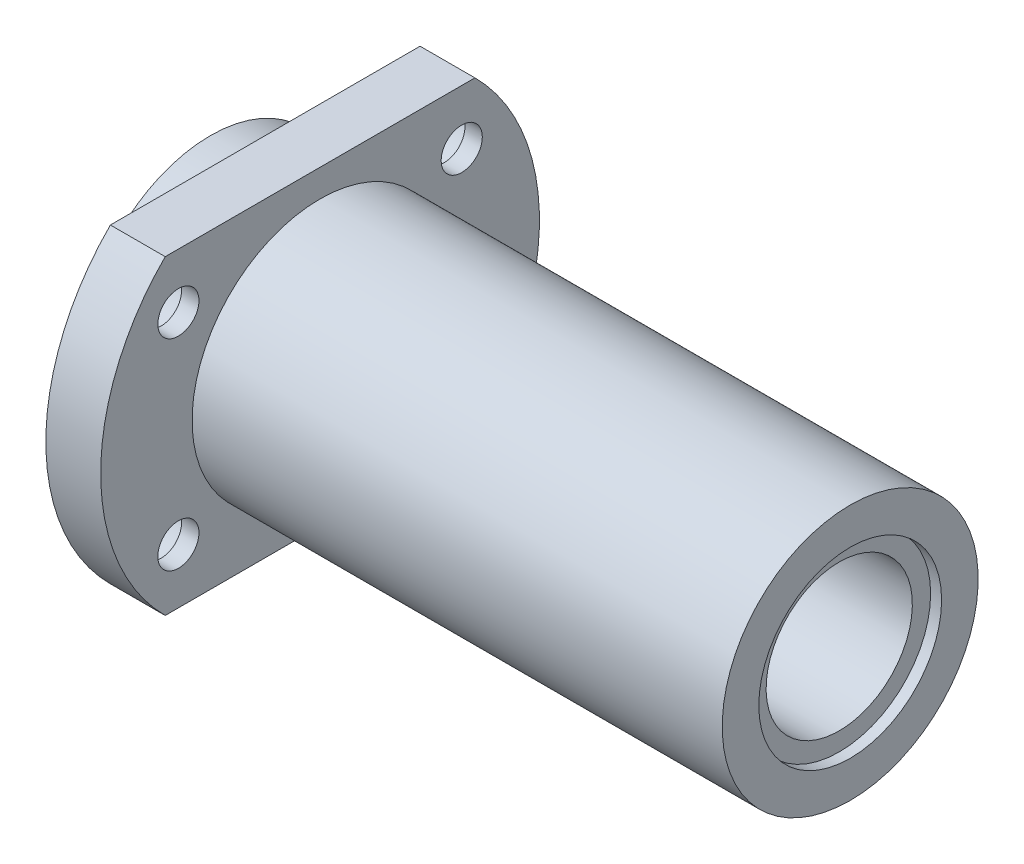
ISO-10303-21;
HEADER;
FILE_DESCRIPTION(('STEP AP214'),'2;1');
FILE_NAME('part.step','',(''),(''),'','','');
FILE_SCHEMA(('AUTOMOTIVE_DESIGN { 1 0 10303 214 1 1 1 1 }'));
ENDSEC;
DATA;
#1=APPLICATION_CONTEXT('core data for automotive mechanical design processes');
#2=APPLICATION_PROTOCOL_DEFINITION('international standard','automotive_design',2000,#1);
#3=PRODUCT_CONTEXT('',#1,'mechanical');
#4=PRODUCT('Part','Part','',(#3));
#5=PRODUCT_RELATED_PRODUCT_CATEGORY('part','',(#4));
#6=PRODUCT_DEFINITION_FORMATION('','',#4);
#7=PRODUCT_DEFINITION_CONTEXT('part definition',#1,'design');
#8=PRODUCT_DEFINITION('design','',#6,#7);
#9=PRODUCT_DEFINITION_SHAPE('','',#8);
#10=(LENGTH_UNIT() NAMED_UNIT(*) SI_UNIT(.MILLI.,.METRE.));
#11=(NAMED_UNIT(*) PLANE_ANGLE_UNIT() SI_UNIT($,.RADIAN.));
#12=(NAMED_UNIT(*) SI_UNIT($,.STERADIAN.) SOLID_ANGLE_UNIT());
#13=UNCERTAINTY_MEASURE_WITH_UNIT(LENGTH_MEASURE(1.E-05),#10,'distance_accuracy_value','');
#14=(GEOMETRIC_REPRESENTATION_CONTEXT(3) GLOBAL_UNCERTAINTY_ASSIGNED_CONTEXT((#13)) GLOBAL_UNIT_ASSIGNED_CONTEXT((#10,
#11,#12)) REPRESENTATION_CONTEXT('',''));
#15=CARTESIAN_POINT('',(0.,0.,0.));
#16=DIRECTION('',(0.,0.,1.));
#17=DIRECTION('',(1.,0.,0.));
#18=AXIS2_PLACEMENT_3D('',#15,#16,#17);
#19=CARTESIAN_POINT('',(70.,0.,0.));
#20=DIRECTION('',(1.,0.,0.));
#21=DIRECTION('',(0.,1.,0.));
#22=AXIS2_PLACEMENT_3D('',#19,#20,#21);
#23=CYLINDRICAL_SURFACE('',#22,24.);
#24=DIRECTION('',(-1.,0.,0.));
#25=VECTOR('',#24,1.);
#26=CARTESIAN_POINT('',(70.,17.,-16.9410743460974));
#27=LINE('',#26,#25);
#28=CARTESIAN_POINT('',(12.,17.,-16.9410743460974));
#29=VERTEX_POINT('',#28);
#30=CARTESIAN_POINT('',(6.00000000000001,17.,-16.9410743460974));
#31=VERTEX_POINT('',#30);
#32=EDGE_CURVE('E49',#29,#31,#27,.T.);
#33=ORIENTED_EDGE('',*,*,#32,.F.);
#34=CARTESIAN_POINT('',(12.,0.,0.));
#35=DIRECTION('',(1.,0.,0.));
#36=DIRECTION('',(0.,1.,0.));
#37=AXIS2_PLACEMENT_3D('',#34,#35,#36);
#38=CIRCLE('',#37,24.);
#39=CARTESIAN_POINT('',(12.,-17.,-16.9410743460974));
#40=VERTEX_POINT('',#39);
#41=EDGE_CURVE('E11',#40,#29,#38,.T.);
#42=ORIENTED_EDGE('',*,*,#41,.F.);
#43=DIRECTION('',(-1.,0.,0.));
#44=VECTOR('',#43,1.);
#45=CARTESIAN_POINT('',(70.,-17.,-16.9410743460974));
#46=LINE('',#45,#44);
#47=CARTESIAN_POINT('',(6.,-17.,-16.9410743460974));
#48=VERTEX_POINT('',#47);
#49=EDGE_CURVE('E196',#40,#48,#46,.T.);
#50=ORIENTED_EDGE('',*,*,#49,.T.);
#51=CARTESIAN_POINT('',(6.00000000000001,0.,0.));
#52=DIRECTION('',(1.,0.,0.));
#53=DIRECTION('',(0.,1.,0.));
#54=AXIS2_PLACEMENT_3D('',#51,#52,#53);
#55=CIRCLE('',#54,24.);
#56=EDGE_CURVE('E89',#48,#31,#55,.T.);
#57=ORIENTED_EDGE('',*,*,#56,.T.);
#58=EDGE_LOOP('',(#33,#42,#50,#57));
#59=FACE_BOUND('',#58,.T.);
#60=ADVANCED_FACE('F32',(#59),#23,.T.);
#61=DIRECTION('',(-1.,0.,0.));
#62=VECTOR('',#61,1.);
#63=CARTESIAN_POINT('',(70.,17.,16.9410743460974));
#64=LINE('',#63,#62);
#65=CARTESIAN_POINT('',(12.,17.,16.9410743460974));
#66=VERTEX_POINT('',#65);
#67=CARTESIAN_POINT('',(6.,17.,16.9410743460974));
#68=VERTEX_POINT('',#67);
#69=EDGE_CURVE('E76',#66,#68,#64,.T.);
#70=ORIENTED_EDGE('',*,*,#69,.T.);
#71=CARTESIAN_POINT('',(6.00000000000001,-17.,16.9410743460974));
#72=VERTEX_POINT('',#71);
#73=EDGE_CURVE('E57',#68,#72,#55,.T.);
#74=ORIENTED_EDGE('',*,*,#73,.T.);
#75=DIRECTION('',(-1.,0.,0.));
#76=VECTOR('',#75,1.);
#77=CARTESIAN_POINT('',(70.,-17.,16.9410743460974));
#78=LINE('',#77,#76);
#79=CARTESIAN_POINT('',(12.,-17.,16.9410743460974));
#80=VERTEX_POINT('',#79);
#81=EDGE_CURVE('E195',#80,#72,#78,.T.);
#82=ORIENTED_EDGE('',*,*,#81,.F.);
#83=EDGE_CURVE('E41',#66,#80,#38,.T.);
#84=ORIENTED_EDGE('',*,*,#83,.F.);
#85=EDGE_LOOP('',(#70,#74,#82,#84));
#86=FACE_BOUND('',#85,.T.);
#87=ADVANCED_FACE('F34',(#86),#23,.T.);
#88=CARTESIAN_POINT('',(12.,12.,0.));
#89=DIRECTION('',(1.,0.,0.));
#90=DIRECTION('',(0.,1.,0.));
#91=AXIS2_PLACEMENT_3D('',#88,#89,#90);
#92=PLANE('',#91);
#93=DIRECTION('',(0.,0.,-1.));
#94=VECTOR('',#93,1.);
#95=CARTESIAN_POINT('',(12.,17.,0.));
#96=LINE('',#95,#94);
#97=EDGE_CURVE('E83',#66,#29,#96,.T.);
#98=ORIENTED_EDGE('',*,*,#97,.F.);
#99=ORIENTED_EDGE('',*,*,#83,.T.);
#100=DIRECTION('',(0.,0.,-1.));
#101=VECTOR('',#100,1.);
#102=CARTESIAN_POINT('',(12.,-17.,0.));
#103=LINE('',#102,#101);
#104=EDGE_CURVE('E191',#80,#40,#103,.T.);
#105=ORIENTED_EDGE('',*,*,#104,.T.);
#106=ORIENTED_EDGE('',*,*,#41,.T.);
#107=EDGE_LOOP('',(#98,#99,#105,#106));
#108=FACE_BOUND('',#107,.T.);
#109=CARTESIAN_POINT('',(12.,0.,0.));
#110=DIRECTION('',(1.,0.,0.));
#111=DIRECTION('',(0.,1.,0.));
#112=AXIS2_PLACEMENT_3D('',#109,#110,#111);
#113=CIRCLE('',#112,14.);
#114=CARTESIAN_POINT('',(12.,14.,0.));
#115=VERTEX_POINT('',#114);
#116=EDGE_CURVE('E124',#115,#115,#113,.T.);
#117=ORIENTED_EDGE('',*,*,#116,.F.);
#118=EDGE_LOOP('',(#117));
#119=FACE_BOUND('',#118,.T.);
#120=CARTESIAN_POINT('',(12.,11.,15.5));
#121=DIRECTION('',(1.,0.,0.));
#122=DIRECTION('',(0.,1.,0.));
#123=AXIS2_PLACEMENT_3D('',#120,#121,#122);
#124=CIRCLE('',#123,2.25);
#125=CARTESIAN_POINT('',(12.,13.25,15.5));
#126=VERTEX_POINT('',#125);
#127=EDGE_CURVE('E90',#126,#126,#124,.T.);
#128=ORIENTED_EDGE('',*,*,#127,.F.);
#129=EDGE_LOOP('',(#128));
#130=FACE_BOUND('',#129,.T.);
#131=CARTESIAN_POINT('',(12.,-11.,-15.5));
#132=DIRECTION('',(1.,0.,0.));
#133=DIRECTION('',(0.,1.,0.));
#134=AXIS2_PLACEMENT_3D('',#131,#132,#133);
#135=CIRCLE('',#134,2.25);
#136=CARTESIAN_POINT('',(12.,-8.75,-15.5));
#137=VERTEX_POINT('',#136);
#138=EDGE_CURVE('E94',#137,#137,#135,.T.);
#139=ORIENTED_EDGE('',*,*,#138,.F.);
#140=EDGE_LOOP('',(#139));
#141=FACE_BOUND('',#140,.T.);
#142=CARTESIAN_POINT('',(12.,11.,-15.5));
#143=DIRECTION('',(1.,0.,0.));
#144=DIRECTION('',(0.,1.,0.));
#145=AXIS2_PLACEMENT_3D('',#142,#143,#144);
#146=CIRCLE('',#145,2.25);
#147=CARTESIAN_POINT('',(12.,13.25,-15.5));
#148=VERTEX_POINT('',#147);
#149=EDGE_CURVE('E163',#148,#148,#146,.T.);
#150=ORIENTED_EDGE('',*,*,#149,.F.);
#151=EDGE_LOOP('',(#150));
#152=FACE_BOUND('',#151,.T.);
#153=CARTESIAN_POINT('',(12.,-11.,15.5));
#154=DIRECTION('',(1.,0.,0.));
#155=DIRECTION('',(0.,1.,0.));
#156=AXIS2_PLACEMENT_3D('',#153,#154,#155);
#157=CIRCLE('',#156,2.25);
#158=CARTESIAN_POINT('',(12.,-8.74999999999997,15.5));
#159=VERTEX_POINT('',#158);
#160=EDGE_CURVE('E130',#159,#159,#157,.T.);
#161=ORIENTED_EDGE('',*,*,#160,.F.);
#162=EDGE_LOOP('',(#161));
#163=FACE_BOUND('',#162,.T.);
#164=ADVANCED_FACE('F171',(#108,#119,#130,#141,#152,#163),#92,.T.);
#165=CARTESIAN_POINT('',(6.,12.,0.));
#166=DIRECTION('',(-1.,0.,0.));
#167=DIRECTION('',(0.,-1.,0.));
#168=AXIS2_PLACEMENT_3D('',#165,#166,#167);
#169=PLANE('',#168);
#170=DIRECTION('',(0.,0.,1.));
#171=VECTOR('',#170,1.);
#172=CARTESIAN_POINT('',(6.,17.,0.));
#173=LINE('',#172,#171);
#174=EDGE_CURVE('E74',#31,#68,#173,.T.);
#175=ORIENTED_EDGE('',*,*,#174,.F.);
#176=ORIENTED_EDGE('',*,*,#56,.F.);
#177=DIRECTION('',(0.,0.,1.));
#178=VECTOR('',#177,1.);
#179=CARTESIAN_POINT('',(6.,-17.,0.));
#180=LINE('',#179,#178);
#181=EDGE_CURVE('E88',#48,#72,#180,.T.);
#182=ORIENTED_EDGE('',*,*,#181,.T.);
#183=ORIENTED_EDGE('',*,*,#73,.F.);
#184=EDGE_LOOP('',(#175,#176,#182,#183));
#185=FACE_BOUND('',#184,.T.);
#186=CARTESIAN_POINT('',(6.00000000000001,0.,0.));
#187=DIRECTION('',(1.,0.,0.));
#188=DIRECTION('',(0.,1.,0.));
#189=AXIS2_PLACEMENT_3D('',#186,#187,#188);
#190=CIRCLE('',#189,14.);
#191=CARTESIAN_POINT('',(6.00000000000001,14.,0.));
#192=VERTEX_POINT('',#191);
#193=EDGE_CURVE('E92',#192,#192,#190,.T.);
#194=ORIENTED_EDGE('',*,*,#193,.T.);
#195=EDGE_LOOP('',(#194));
#196=FACE_BOUND('',#195,.T.);
#197=CARTESIAN_POINT('',(6.,11.,15.5));
#198=DIRECTION('',(-1.,0.,0.));
#199=DIRECTION('',(0.,-1.,0.));
#200=AXIS2_PLACEMENT_3D('',#197,#198,#199);
#201=CIRCLE('',#200,3.75);
#202=CARTESIAN_POINT('',(6.,7.24999999999997,15.5));
#203=VERTEX_POINT('',#202);
#204=EDGE_CURVE('E134',#203,#203,#201,.T.);
#205=ORIENTED_EDGE('',*,*,#204,.F.);
#206=EDGE_LOOP('',(#205));
#207=FACE_BOUND('',#206,.T.);
#208=CARTESIAN_POINT('',(6.,11.,-15.5));
#209=DIRECTION('',(-1.,0.,0.));
#210=DIRECTION('',(0.,-1.,0.));
#211=AXIS2_PLACEMENT_3D('',#208,#209,#210);
#212=CIRCLE('',#211,3.75);
#213=CARTESIAN_POINT('',(6.,7.25,-15.5));
#214=VERTEX_POINT('',#213);
#215=EDGE_CURVE('E138',#214,#214,#212,.T.);
#216=ORIENTED_EDGE('',*,*,#215,.F.);
#217=EDGE_LOOP('',(#216));
#218=FACE_BOUND('',#217,.T.);
#219=CARTESIAN_POINT('',(6.,-11.,-15.5));
#220=DIRECTION('',(-1.,0.,0.));
#221=DIRECTION('',(0.,-1.,0.));
#222=AXIS2_PLACEMENT_3D('',#219,#220,#221);
#223=CIRCLE('',#222,3.75);
#224=CARTESIAN_POINT('',(6.,-14.75,-15.5));
#225=VERTEX_POINT('',#224);
#226=EDGE_CURVE('E145',#225,#225,#223,.T.);
#227=ORIENTED_EDGE('',*,*,#226,.F.);
#228=EDGE_LOOP('',(#227));
#229=FACE_BOUND('',#228,.T.);
#230=CARTESIAN_POINT('',(6.,-11.,15.5));
#231=DIRECTION('',(-1.,0.,0.));
#232=DIRECTION('',(0.,-1.,0.));
#233=AXIS2_PLACEMENT_3D('',#230,#231,#232);
#234=CIRCLE('',#233,3.75);
#235=CARTESIAN_POINT('',(6.,-14.75,15.5));
#236=VERTEX_POINT('',#235);
#237=EDGE_CURVE('E152',#236,#236,#234,.T.);
#238=ORIENTED_EDGE('',*,*,#237,.F.);
#239=EDGE_LOOP('',(#238));
#240=FACE_BOUND('',#239,.T.);
#241=ADVANCED_FACE('F86',(#185,#196,#207,#218,#229,#240),#169,.T.);
#242=CARTESIAN_POINT('',(70.,-11.,15.5));
#243=DIRECTION('',(-1.,0.,0.));
#244=DIRECTION('',(0.,-1.,0.));
#245=AXIS2_PLACEMENT_3D('',#242,#243,#244);
#246=CYLINDRICAL_SURFACE('',#245,2.25);
#247=ORIENTED_EDGE('',*,*,#160,.T.);
#248=EDGE_LOOP('',(#247));
#249=FACE_BOUND('',#248,.T.);
#250=CARTESIAN_POINT('',(10.1,-11.,15.5));
#251=DIRECTION('',(-1.,0.,0.));
#252=DIRECTION('',(0.,-1.,0.));
#253=AXIS2_PLACEMENT_3D('',#250,#251,#252);
#254=CIRCLE('',#253,2.25);
#255=CARTESIAN_POINT('',(10.1,-13.25,15.5));
#256=VERTEX_POINT('',#255);
#257=EDGE_CURVE('E36',#256,#256,#254,.F.);
#258=ORIENTED_EDGE('',*,*,#257,.F.);
#259=EDGE_LOOP('',(#258));
#260=FACE_BOUND('',#259,.T.);
#261=ADVANCED_FACE('F179',(#249,#260),#246,.F.);
#262=CARTESIAN_POINT('',(70.,-11.,-15.5));
#263=DIRECTION('',(-1.,0.,0.));
#264=DIRECTION('',(0.,-1.,0.));
#265=AXIS2_PLACEMENT_3D('',#262,#263,#264);
#266=CYLINDRICAL_SURFACE('',#265,2.25);
#267=ORIENTED_EDGE('',*,*,#138,.T.);
#268=EDGE_LOOP('',(#267));
#269=FACE_BOUND('',#268,.T.);
#270=CARTESIAN_POINT('',(10.1,-11.,-15.5));
#271=DIRECTION('',(-1.,0.,0.));
#272=DIRECTION('',(0.,-1.,0.));
#273=AXIS2_PLACEMENT_3D('',#270,#271,#272);
#274=CIRCLE('',#273,2.25);
#275=CARTESIAN_POINT('',(10.1,-13.25,-15.5));
#276=VERTEX_POINT('',#275);
#277=EDGE_CURVE('E136',#276,#276,#274,.F.);
#278=ORIENTED_EDGE('',*,*,#277,.F.);
#279=EDGE_LOOP('',(#278));
#280=FACE_BOUND('',#279,.T.);
#281=ADVANCED_FACE('F168',(#269,#280),#266,.F.);
#282=CARTESIAN_POINT('',(70.,11.,-15.5));
#283=DIRECTION('',(-1.,0.,0.));
#284=DIRECTION('',(0.,-1.,0.));
#285=AXIS2_PLACEMENT_3D('',#282,#283,#284);
#286=CYLINDRICAL_SURFACE('',#285,2.25);
#287=ORIENTED_EDGE('',*,*,#149,.T.);
#288=EDGE_LOOP('',(#287));
#289=FACE_BOUND('',#288,.T.);
#290=CARTESIAN_POINT('',(10.1,11.,-15.5));
#291=DIRECTION('',(-1.,0.,0.));
#292=DIRECTION('',(0.,-1.,0.));
#293=AXIS2_PLACEMENT_3D('',#290,#291,#292);
#294=CIRCLE('',#293,2.25);
#295=CARTESIAN_POINT('',(10.1,8.75,-15.5));
#296=VERTEX_POINT('',#295);
#297=EDGE_CURVE('E132',#296,#296,#294,.F.);
#298=ORIENTED_EDGE('',*,*,#297,.F.);
#299=EDGE_LOOP('',(#298));
#300=FACE_BOUND('',#299,.T.);
#301=ADVANCED_FACE('F247',(#289,#300),#286,.F.);
#302=CARTESIAN_POINT('',(70.,11.,15.5));
#303=DIRECTION('',(-1.,0.,0.));
#304=DIRECTION('',(0.,-1.,0.));
#305=AXIS2_PLACEMENT_3D('',#302,#303,#304);
#306=CYLINDRICAL_SURFACE('',#305,2.25);
#307=ORIENTED_EDGE('',*,*,#127,.T.);
#308=EDGE_LOOP('',(#307));
#309=FACE_BOUND('',#308,.T.);
#310=CARTESIAN_POINT('',(10.1,11.,15.5));
#311=DIRECTION('',(-1.,0.,0.));
#312=DIRECTION('',(0.,-1.,0.));
#313=AXIS2_PLACEMENT_3D('',#310,#311,#312);
#314=CIRCLE('',#313,2.25);
#315=CARTESIAN_POINT('',(10.1,8.74999999999997,15.5));
#316=VERTEX_POINT('',#315);
#317=EDGE_CURVE('E127',#316,#316,#314,.F.);
#318=ORIENTED_EDGE('',*,*,#317,.F.);
#319=EDGE_LOOP('',(#318));
#320=FACE_BOUND('',#319,.T.);
#321=ADVANCED_FACE('F254',(#309,#320),#306,.F.);
#322=CARTESIAN_POINT('',(70.,0.,0.));
#323=DIRECTION('',(1.,0.,0.));
#324=DIRECTION('',(0.,1.,0.));
#325=AXIS2_PLACEMENT_3D('',#322,#323,#324);
#326=CYLINDRICAL_SURFACE('',#325,14.);
#327=ORIENTED_EDGE('',*,*,#116,.T.);
#328=EDGE_LOOP('',(#327));
#329=FACE_BOUND('',#328,.T.);
#330=CARTESIAN_POINT('',(70.,0.,0.));
#331=DIRECTION('',(1.,0.,0.));
#332=DIRECTION('',(0.,1.,0.));
#333=AXIS2_PLACEMENT_3D('',#330,#331,#332);
#334=CIRCLE('',#333,14.);
#335=CARTESIAN_POINT('',(70.,14.,0.));
#336=VERTEX_POINT('',#335);
#337=EDGE_CURVE('E121',#336,#336,#334,.T.);
#338=ORIENTED_EDGE('',*,*,#337,.F.);
#339=EDGE_LOOP('',(#338));
#340=FACE_BOUND('',#339,.T.);
#341=ADVANCED_FACE('F262',(#329,#340),#326,.T.);
#342=CARTESIAN_POINT('',(70.,12.,0.));
#343=DIRECTION('',(1.,0.,0.));
#344=DIRECTION('',(0.,1.,0.));
#345=AXIS2_PLACEMENT_3D('',#342,#343,#344);
#346=PLANE('',#345);
#347=ORIENTED_EDGE('',*,*,#337,.T.);
#348=EDGE_LOOP('',(#347));
#349=FACE_BOUND('',#348,.T.);
#350=CARTESIAN_POINT('',(70.,0.,0.));
#351=DIRECTION('',(1.,0.,0.));
#352=DIRECTION('',(0.,1.,0.));
#353=AXIS2_PLACEMENT_3D('',#350,#351,#352);
#354=CIRCLE('',#353,9.99999999999999);
#355=CARTESIAN_POINT('',(70.,9.99999999999999,0.));
#356=VERTEX_POINT('',#355);
#357=EDGE_CURVE('E118',#356,#356,#354,.T.);
#358=ORIENTED_EDGE('',*,*,#357,.F.);
#359=EDGE_LOOP('',(#358));
#360=FACE_BOUND('',#359,.T.);
#361=ADVANCED_FACE('F271',(#349,#360),#346,.T.);
#362=CARTESIAN_POINT('',(70.,0.,0.));
#363=DIRECTION('',(1.,0.,0.));
#364=DIRECTION('',(0.,1.,0.));
#365=AXIS2_PLACEMENT_3D('',#362,#363,#364);
#366=CYLINDRICAL_SURFACE('',#365,9.99999999999999);
#367=CARTESIAN_POINT('',(68.8,0.,0.));
#368=DIRECTION('',(1.,0.,0.));
#369=DIRECTION('',(0.,1.,0.));
#370=AXIS2_PLACEMENT_3D('',#367,#368,#369);
#371=CIRCLE('',#370,9.99999999999999);
#372=CARTESIAN_POINT('',(68.8,9.99999999999999,0.));
#373=VERTEX_POINT('',#372);
#374=EDGE_CURVE('E115',#373,#373,#371,.T.);
#375=ORIENTED_EDGE('',*,*,#374,.F.);
#376=EDGE_LOOP('',(#375));
#377=FACE_BOUND('',#376,.T.);
#378=ORIENTED_EDGE('',*,*,#357,.T.);
#379=EDGE_LOOP('',(#378));
#380=FACE_BOUND('',#379,.T.);
#381=ADVANCED_FACE('F279',(#377,#380),#366,.F.);
#382=CARTESIAN_POINT('',(68.8,12.,0.));
#383=DIRECTION('',(-1.,0.,0.));
#384=DIRECTION('',(0.,-1.,0.));
#385=AXIS2_PLACEMENT_3D('',#382,#383,#384);
#386=PLANE('',#385);
#387=CARTESIAN_POINT('',(68.8,0.,0.));
#388=DIRECTION('',(1.,0.,0.));
#389=DIRECTION('',(0.,1.,0.));
#390=AXIS2_PLACEMENT_3D('',#387,#388,#389);
#391=CIRCLE('',#390,7.99999999999999);
#392=CARTESIAN_POINT('',(68.8,7.99999999999999,0.));
#393=VERTEX_POINT('',#392);
#394=EDGE_CURVE('E112',#393,#393,#391,.T.);
#395=ORIENTED_EDGE('',*,*,#394,.F.);
#396=EDGE_LOOP('',(#395));
#397=FACE_BOUND('',#396,.T.);
#398=ORIENTED_EDGE('',*,*,#374,.T.);
#399=EDGE_LOOP('',(#398));
#400=FACE_BOUND('',#399,.T.);
#401=ADVANCED_FACE('F287',(#397,#400),#386,.F.);
#402=CARTESIAN_POINT('',(70.,0.,0.));
#403=DIRECTION('',(1.,0.,0.));
#404=DIRECTION('',(0.,1.,0.));
#405=AXIS2_PLACEMENT_3D('',#402,#403,#404);
#406=CYLINDRICAL_SURFACE('',#405,7.99999999999999);
#407=CARTESIAN_POINT('',(1.20000000000001,0.,0.));
#408=DIRECTION('',(1.,0.,0.));
#409=DIRECTION('',(0.,1.,0.));
#410=AXIS2_PLACEMENT_3D('',#407,#408,#409);
#411=CIRCLE('',#410,7.99999999999999);
#412=CARTESIAN_POINT('',(1.20000000000001,7.99999999999999,0.));
#413=VERTEX_POINT('',#412);
#414=EDGE_CURVE('E109',#413,#413,#411,.T.);
#415=ORIENTED_EDGE('',*,*,#414,.F.);
#416=EDGE_LOOP('',(#415));
#417=FACE_BOUND('',#416,.T.);
#418=ORIENTED_EDGE('',*,*,#394,.T.);
#419=EDGE_LOOP('',(#418));
#420=FACE_BOUND('',#419,.T.);
#421=ADVANCED_FACE('F295',(#417,#420),#406,.F.);
#422=CARTESIAN_POINT('',(1.20000000000001,12.,0.));
#423=DIRECTION('',(1.,0.,0.));
#424=DIRECTION('',(0.,1.,0.));
#425=AXIS2_PLACEMENT_3D('',#422,#423,#424);
#426=PLANE('',#425);
#427=CARTESIAN_POINT('',(1.20000000000001,0.,0.));
#428=DIRECTION('',(1.,0.,0.));
#429=DIRECTION('',(0.,1.,0.));
#430=AXIS2_PLACEMENT_3D('',#427,#428,#429);
#431=CIRCLE('',#430,9.99999999999999);
#432=CARTESIAN_POINT('',(1.20000000000001,9.99999999999999,0.));
#433=VERTEX_POINT('',#432);
#434=EDGE_CURVE('E106',#433,#433,#431,.T.);
#435=ORIENTED_EDGE('',*,*,#434,.F.);
#436=EDGE_LOOP('',(#435));
#437=FACE_BOUND('',#436,.T.);
#438=ORIENTED_EDGE('',*,*,#414,.T.);
#439=EDGE_LOOP('',(#438));
#440=FACE_BOUND('',#439,.T.);
#441=ADVANCED_FACE('F303',(#437,#440),#426,.F.);
#442=CARTESIAN_POINT('',(70.,0.,0.));
#443=DIRECTION('',(1.,0.,0.));
#444=DIRECTION('',(0.,1.,0.));
#445=AXIS2_PLACEMENT_3D('',#442,#443,#444);
#446=CYLINDRICAL_SURFACE('',#445,9.99999999999999);
#447=CARTESIAN_POINT('',(0.,0.,0.));
#448=DIRECTION('',(1.,0.,0.));
#449=DIRECTION('',(0.,1.,0.));
#450=AXIS2_PLACEMENT_3D('',#447,#448,#449);
#451=CIRCLE('',#450,9.99999999999999);
#452=CARTESIAN_POINT('',(0.,9.99999999999999,0.));
#453=VERTEX_POINT('',#452);
#454=EDGE_CURVE('E103',#453,#453,#451,.T.);
#455=ORIENTED_EDGE('',*,*,#454,.F.);
#456=EDGE_LOOP('',(#455));
#457=FACE_BOUND('',#456,.T.);
#458=ORIENTED_EDGE('',*,*,#434,.T.);
#459=EDGE_LOOP('',(#458));
#460=FACE_BOUND('',#459,.T.);
#461=ADVANCED_FACE('F311',(#457,#460),#446,.F.);
#462=CARTESIAN_POINT('',(0.,12.,0.));
#463=DIRECTION('',(1.,0.,0.));
#464=DIRECTION('',(0.,1.,0.));
#465=AXIS2_PLACEMENT_3D('',#462,#463,#464);
#466=PLANE('',#465);
#467=CARTESIAN_POINT('',(0.,0.,0.));
#468=DIRECTION('',(1.,0.,0.));
#469=DIRECTION('',(0.,1.,0.));
#470=AXIS2_PLACEMENT_3D('',#467,#468,#469);
#471=CIRCLE('',#470,14.000000000005);
#472=CARTESIAN_POINT('',(0.,14.000000000005,0.));
#473=VERTEX_POINT('',#472);
#474=EDGE_CURVE('E100',#473,#473,#471,.T.);
#475=ORIENTED_EDGE('',*,*,#474,.F.);
#476=EDGE_LOOP('',(#475));
#477=FACE_BOUND('',#476,.T.);
#478=ORIENTED_EDGE('',*,*,#454,.T.);
#479=EDGE_LOOP('',(#478));
#480=FACE_BOUND('',#479,.T.);
#481=ADVANCED_FACE('F319',(#477,#480),#466,.F.);
#482=CARTESIAN_POINT('',(70.,0.,0.));
#483=DIRECTION('',(1.,0.,0.));
#484=DIRECTION('',(0.,1.,0.));
#485=AXIS2_PLACEMENT_3D('',#482,#483,#484);
#486=CYLINDRICAL_SURFACE('',#485,14.0000000000025);
#487=ORIENTED_EDGE('',*,*,#193,.F.);
#488=EDGE_LOOP('',(#487));
#489=FACE_BOUND('',#488,.T.);
#490=ORIENTED_EDGE('',*,*,#474,.T.);
#491=EDGE_LOOP('',(#490));
#492=FACE_BOUND('',#491,.T.);
#493=ADVANCED_FACE('F327',(#489,#492),#486,.T.);
#494=CARTESIAN_POINT('',(10.1,11.,15.5));
#495=DIRECTION('',(-1.,0.,0.));
#496=DIRECTION('',(0.,-1.,0.));
#497=AXIS2_PLACEMENT_3D('',#494,#495,#496);
#498=PLANE('',#497);
#499=CARTESIAN_POINT('',(10.1,11.,15.5));
#500=DIRECTION('',(-1.,0.,0.));
#501=DIRECTION('',(0.,-1.,0.));
#502=AXIS2_PLACEMENT_3D('',#499,#500,#501);
#503=CIRCLE('',#502,3.75);
#504=CARTESIAN_POINT('',(10.1,7.24999999999997,15.5));
#505=VERTEX_POINT('',#504);
#506=EDGE_CURVE('E131',#505,#505,#503,.T.);
#507=ORIENTED_EDGE('',*,*,#506,.T.);
#508=EDGE_LOOP('',(#507));
#509=FACE_BOUND('',#508,.T.);
#510=ORIENTED_EDGE('',*,*,#317,.T.);
#511=EDGE_LOOP('',(#510));
#512=FACE_BOUND('',#511,.T.);
#513=ADVANCED_FACE('F334',(#509,#512),#498,.T.);
#514=CARTESIAN_POINT('',(10.1,11.,15.5));
#515=DIRECTION('',(-1.,0.,0.));
#516=DIRECTION('',(0.,-1.,0.));
#517=AXIS2_PLACEMENT_3D('',#514,#515,#516);
#518=CYLINDRICAL_SURFACE('',#517,3.75);
#519=ORIENTED_EDGE('',*,*,#506,.F.);
#520=EDGE_LOOP('',(#519));
#521=FACE_BOUND('',#520,.T.);
#522=ORIENTED_EDGE('',*,*,#204,.T.);
#523=EDGE_LOOP('',(#522));
#524=FACE_BOUND('',#523,.T.);
#525=ADVANCED_FACE('F341',(#521,#524),#518,.F.);
#526=CARTESIAN_POINT('',(10.1,11.,-15.5));
#527=DIRECTION('',(-1.,0.,0.));
#528=DIRECTION('',(0.,-1.,0.));
#529=AXIS2_PLACEMENT_3D('',#526,#527,#528);
#530=PLANE('',#529);
#531=CARTESIAN_POINT('',(10.1,11.,-15.5));
#532=DIRECTION('',(-1.,0.,0.));
#533=DIRECTION('',(0.,-1.,0.));
#534=AXIS2_PLACEMENT_3D('',#531,#532,#533);
#535=CIRCLE('',#534,3.75);
#536=CARTESIAN_POINT('',(10.1,7.25,-15.5));
#537=VERTEX_POINT('',#536);
#538=EDGE_CURVE('E135',#537,#537,#535,.T.);
#539=ORIENTED_EDGE('',*,*,#538,.T.);
#540=EDGE_LOOP('',(#539));
#541=FACE_BOUND('',#540,.T.);
#542=ORIENTED_EDGE('',*,*,#297,.T.);
#543=EDGE_LOOP('',(#542));
#544=FACE_BOUND('',#543,.T.);
#545=ADVANCED_FACE('F349',(#541,#544),#530,.T.);
#546=CARTESIAN_POINT('',(10.1,11.,-15.5));
#547=DIRECTION('',(-1.,0.,0.));
#548=DIRECTION('',(0.,-1.,0.));
#549=AXIS2_PLACEMENT_3D('',#546,#547,#548);
#550=CYLINDRICAL_SURFACE('',#549,3.75);
#551=ORIENTED_EDGE('',*,*,#538,.F.);
#552=EDGE_LOOP('',(#551));
#553=FACE_BOUND('',#552,.T.);
#554=ORIENTED_EDGE('',*,*,#215,.T.);
#555=EDGE_LOOP('',(#554));
#556=FACE_BOUND('',#555,.T.);
#557=ADVANCED_FACE('F357',(#553,#556),#550,.F.);
#558=CARTESIAN_POINT('',(10.1,-11.,-15.5));
#559=DIRECTION('',(-1.,0.,0.));
#560=DIRECTION('',(0.,-1.,0.));
#561=AXIS2_PLACEMENT_3D('',#558,#559,#560);
#562=PLANE('',#561);
#563=CARTESIAN_POINT('',(10.1,-11.,-15.5));
#564=DIRECTION('',(-1.,0.,0.));
#565=DIRECTION('',(0.,-1.,0.));
#566=AXIS2_PLACEMENT_3D('',#563,#564,#565);
#567=CIRCLE('',#566,3.75);
#568=CARTESIAN_POINT('',(10.1,-14.75,-15.5));
#569=VERTEX_POINT('',#568);
#570=EDGE_CURVE('E139',#569,#569,#567,.T.);
#571=ORIENTED_EDGE('',*,*,#570,.T.);
#572=EDGE_LOOP('',(#571));
#573=FACE_BOUND('',#572,.T.);
#574=ORIENTED_EDGE('',*,*,#277,.T.);
#575=EDGE_LOOP('',(#574));
#576=FACE_BOUND('',#575,.T.);
#577=ADVANCED_FACE('F365',(#573,#576),#562,.T.);
#578=CARTESIAN_POINT('',(10.1,-11.,-15.5));
#579=DIRECTION('',(-1.,0.,0.));
#580=DIRECTION('',(0.,-1.,0.));
#581=AXIS2_PLACEMENT_3D('',#578,#579,#580);
#582=CYLINDRICAL_SURFACE('',#581,3.75);
#583=ORIENTED_EDGE('',*,*,#570,.F.);
#584=EDGE_LOOP('',(#583));
#585=FACE_BOUND('',#584,.T.);
#586=ORIENTED_EDGE('',*,*,#226,.T.);
#587=EDGE_LOOP('',(#586));
#588=FACE_BOUND('',#587,.T.);
#589=ADVANCED_FACE('F373',(#585,#588),#582,.F.);
#590=CARTESIAN_POINT('',(10.1,-11.,15.5));
#591=DIRECTION('',(-1.,0.,0.));
#592=DIRECTION('',(0.,-1.,0.));
#593=AXIS2_PLACEMENT_3D('',#590,#591,#592);
#594=PLANE('',#593);
#595=CARTESIAN_POINT('',(10.1,-11.,15.5));
#596=DIRECTION('',(-1.,0.,0.));
#597=DIRECTION('',(0.,-1.,0.));
#598=AXIS2_PLACEMENT_3D('',#595,#596,#597);
#599=CIRCLE('',#598,3.75);
#600=CARTESIAN_POINT('',(10.1,-14.75,15.5));
#601=VERTEX_POINT('',#600);
#602=EDGE_CURVE('E186',#601,#601,#599,.T.);
#603=ORIENTED_EDGE('',*,*,#602,.T.);
#604=EDGE_LOOP('',(#603));
#605=FACE_BOUND('',#604,.T.);
#606=ORIENTED_EDGE('',*,*,#257,.T.);
#607=EDGE_LOOP('',(#606));
#608=FACE_BOUND('',#607,.T.);
#609=ADVANCED_FACE('F216',(#605,#608),#594,.T.);
#610=CARTESIAN_POINT('',(10.1,-11.,15.5));
#611=DIRECTION('',(-1.,0.,0.));
#612=DIRECTION('',(0.,-1.,0.));
#613=AXIS2_PLACEMENT_3D('',#610,#611,#612);
#614=CYLINDRICAL_SURFACE('',#613,3.75);
#615=ORIENTED_EDGE('',*,*,#602,.F.);
#616=EDGE_LOOP('',(#615));
#617=FACE_BOUND('',#616,.T.);
#618=ORIENTED_EDGE('',*,*,#237,.T.);
#619=EDGE_LOOP('',(#618));
#620=FACE_BOUND('',#619,.T.);
#621=ADVANCED_FACE('F209',(#617,#620),#614,.F.);
#622=CARTESIAN_POINT('',(70.,-17.,0.));
#623=DIRECTION('',(0.,-1.,0.));
#624=DIRECTION('',(1.,0.,0.));
#625=AXIS2_PLACEMENT_3D('',#622,#623,#624);
#626=PLANE('',#625);
#627=ORIENTED_EDGE('',*,*,#81,.T.);
#628=ORIENTED_EDGE('',*,*,#181,.F.);
#629=ORIENTED_EDGE('',*,*,#49,.F.);
#630=ORIENTED_EDGE('',*,*,#104,.F.);
#631=EDGE_LOOP('',(#627,#628,#629,#630));
#632=FACE_BOUND('',#631,.T.);
#633=ADVANCED_FACE('F207',(#632),#626,.T.);
#634=CARTESIAN_POINT('',(70.,17.,0.));
#635=DIRECTION('',(0.,-1.,0.));
#636=DIRECTION('',(1.,0.,0.));
#637=AXIS2_PLACEMENT_3D('',#634,#635,#636);
#638=PLANE('',#637);
#639=ORIENTED_EDGE('',*,*,#97,.T.);
#640=ORIENTED_EDGE('',*,*,#32,.T.);
#641=ORIENTED_EDGE('',*,*,#174,.T.);
#642=ORIENTED_EDGE('',*,*,#69,.F.);
#643=EDGE_LOOP('',(#639,#640,#641,#642));
#644=FACE_BOUND('',#643,.T.);
#645=ADVANCED_FACE('F75',(#644),#638,.F.);
#646=CLOSED_SHELL('',(#60,#87,#164,#241,#261,#281,#301,#321,#341,#361,#381,#401,#421,#441,#461,
#481,#493,#513,#525,#545,#557,#577,#589,#609,#621,#633,#645));
#647=MANIFOLD_SOLID_BREP('B2',#646);
#648=ADVANCED_BREP_SHAPE_REPRESENTATION('',(#18,#647),#14);
#649=SHAPE_DEFINITION_REPRESENTATION(#9,#648);
ENDSEC;
END-ISO-10303-21;
